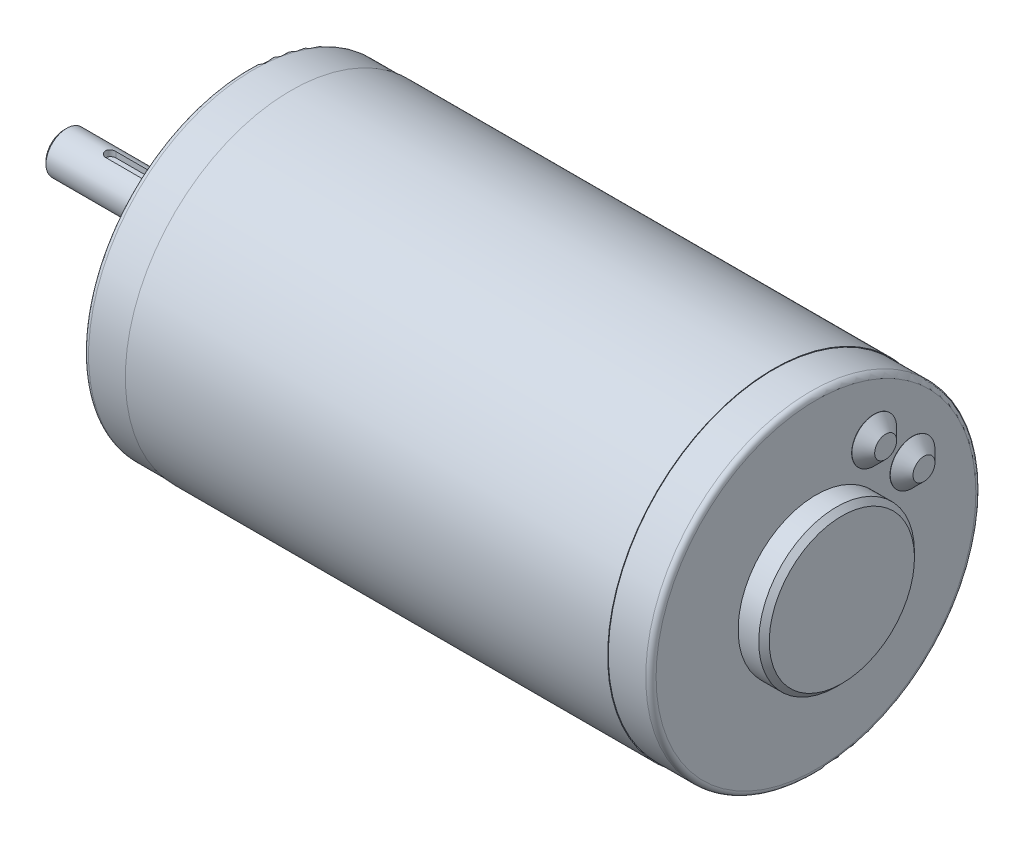
ISO-10303-21;
HEADER;
FILE_DESCRIPTION(('STEP AP214'),'2;1');
FILE_NAME('part.step','',(''),(''),'','','');
FILE_SCHEMA(('AUTOMOTIVE_DESIGN { 1 0 10303 214 1 1 1 1 }'));
ENDSEC;
DATA;
#1=APPLICATION_CONTEXT('core data for automotive mechanical design processes');
#2=APPLICATION_PROTOCOL_DEFINITION('international standard','automotive_design',2000,#1);
#3=PRODUCT_CONTEXT('',#1,'mechanical');
#4=PRODUCT('Part','Part','',(#3));
#5=PRODUCT_RELATED_PRODUCT_CATEGORY('part','',(#4));
#6=PRODUCT_DEFINITION_FORMATION('','',#4);
#7=PRODUCT_DEFINITION_CONTEXT('part definition',#1,'design');
#8=PRODUCT_DEFINITION('design','',#6,#7);
#9=PRODUCT_DEFINITION_SHAPE('','',#8);
#10=(LENGTH_UNIT() NAMED_UNIT(*) SI_UNIT(.MILLI.,.METRE.));
#11=(NAMED_UNIT(*) PLANE_ANGLE_UNIT() SI_UNIT($,.RADIAN.));
#12=(NAMED_UNIT(*) SI_UNIT($,.STERADIAN.) SOLID_ANGLE_UNIT());
#13=UNCERTAINTY_MEASURE_WITH_UNIT(LENGTH_MEASURE(1.E-05),#10,'distance_accuracy_value','');
#14=(GEOMETRIC_REPRESENTATION_CONTEXT(3) GLOBAL_UNCERTAINTY_ASSIGNED_CONTEXT((#13)) GLOBAL_UNIT_ASSIGNED_CONTEXT((#10,
#11,#12)) REPRESENTATION_CONTEXT('',''));
#15=CARTESIAN_POINT('',(0.,0.,0.));
#16=DIRECTION('',(0.,0.,1.));
#17=DIRECTION('',(1.,0.,0.));
#18=AXIS2_PLACEMENT_3D('',#15,#16,#17);
#19=CARTESIAN_POINT('',(-27.6,2.79999999999999,-1.));
#20=DIRECTION('',(0.,-1.,0.));
#21=DIRECTION('',(0.,0.,-1.));
#22=AXIS2_PLACEMENT_3D('',#19,#20,#21);
#23=PLANE('',#22);
#24=CARTESIAN_POINT('',(-7.1,2.79999999999999,0.));
#25=DIRECTION('',(0.,1.,0.));
#26=DIRECTION('',(0.,0.,1.));
#27=AXIS2_PLACEMENT_3D('',#24,#25,#26);
#28=CIRCLE('',#27,1.);
#29=CARTESIAN_POINT('',(-7.1,2.79999999999999,1.));
#30=VERTEX_POINT('',#29);
#31=CARTESIAN_POINT('',(-7.1,2.79999999999999,-1.));
#32=VERTEX_POINT('',#31);
#33=EDGE_CURVE('E81',#30,#32,#28,.T.);
#34=ORIENTED_EDGE('',*,*,#33,.T.);
#35=DIRECTION('',(1.,0.,0.));
#36=VECTOR('',#35,1.);
#37=CARTESIAN_POINT('',(-27.6,2.79999999999999,-1.));
#38=LINE('',#37,#36);
#39=CARTESIAN_POINT('',(-26.6,2.79999999999999,-1.));
#40=VERTEX_POINT('',#39);
#41=EDGE_CURVE('E76',#40,#32,#38,.T.);
#42=ORIENTED_EDGE('',*,*,#41,.F.);
#43=CARTESIAN_POINT('',(-26.6,2.79999999999999,0.));
#44=DIRECTION('',(0.,-1.,0.));
#45=DIRECTION('',(0.,0.,-1.));
#46=AXIS2_PLACEMENT_3D('',#43,#44,#45);
#47=CIRCLE('',#46,1.);
#48=CARTESIAN_POINT('',(-26.6,2.79999999999999,1.));
#49=VERTEX_POINT('',#48);
#50=EDGE_CURVE('E78',#40,#49,#47,.F.);
#51=ORIENTED_EDGE('',*,*,#50,.T.);
#52=DIRECTION('',(1.,0.,0.));
#53=VECTOR('',#52,1.);
#54=CARTESIAN_POINT('',(-27.6,2.79999999999999,1.));
#55=LINE('',#54,#53);
#56=EDGE_CURVE('E104',#49,#30,#55,.T.);
#57=ORIENTED_EDGE('',*,*,#56,.T.);
#58=EDGE_LOOP('',(#34,#42,#51,#57));
#59=FACE_BOUND('',#58,.T.);
#60=ADVANCED_FACE('F18',(#59),#23,.F.);
#61=CARTESIAN_POINT('',(-35.6,0.,0.));
#62=DIRECTION('',(-1.,0.,0.));
#63=DIRECTION('',(0.,0.,1.));
#64=AXIS2_PLACEMENT_3D('',#61,#62,#63);
#65=PLANE('',#64);
#66=CARTESIAN_POINT('',(-35.6000000000449,0.,0.));
#67=DIRECTION('',(1.,0.,0.));
#68=DIRECTION('',(0.,0.,-1.));
#69=AXIS2_PLACEMENT_3D('',#66,#67,#68);
#70=CIRCLE('',#69,3.49999999997408);
#71=CARTESIAN_POINT('',(-35.6000000000449,0.,-3.49999999997408));
#72=VERTEX_POINT('',#71);
#73=EDGE_CURVE('E326',#72,#72,#70,.T.);
#74=ORIENTED_EDGE('',*,*,#73,.F.);
#75=EDGE_LOOP('',(#74));
#76=FACE_BOUND('',#75,.T.);
#77=ADVANCED_FACE('F614',(#76),#65,.T.);
#78=CARTESIAN_POINT('',(-26.6,3.87298334620741,0.));
#79=DIRECTION('',(0.,-1.,0.));
#80=DIRECTION('',(0.,0.,-1.));
#81=AXIS2_PLACEMENT_3D('',#78,#79,#80);
#82=CYLINDRICAL_SURFACE('',#81,1.);
#83=CARTESIAN_POINT('',(-26.6,3.87298334620741,1.));
#84=CARTESIAN_POINT('',(-26.6276629851065,3.87298148580177,1.00000033749611));
#85=CARTESIAN_POINT('',(-26.6553122630182,3.8732800994947,0.998851407375366));
#86=CARTESIAN_POINT('',(-26.7104040353036,3.87445904774558,0.994271295395754));
#87=CARTESIAN_POINT('',(-26.7378465636871,3.87533928441687,0.99084049757268));
#88=CARTESIAN_POINT('',(-26.8194531732088,3.87881710972053,0.977175239382527));
#89=CARTESIAN_POINT('',(-26.8730564684822,3.88225203148808,0.963567695172493));
#90=CARTESIAN_POINT('',(-26.977124673782,3.89095422588002,0.927798076247996));
#91=CARTESIAN_POINT('',(-27.0275898782129,3.89622132630929,0.905636805423835));
#92=CARTESIAN_POINT('',(-27.1241114486473,3.90799134471939,0.853415378025865));
#93=CARTESIAN_POINT('',(-27.170166627891,3.91449459395647,0.823353103356933));
#94=CARTESIAN_POINT('',(-27.2575438819061,3.92816262398025,0.755484471828068));
#95=CARTESIAN_POINT('',(-27.2987548862455,3.93533791028915,0.717537268783974));
#96=CARTESIAN_POINT('',(-27.3743020894827,3.94945104396193,0.635275780516228));
#97=CARTESIAN_POINT('',(-27.4086371894679,3.95638885322537,0.590960479478829));
#98=CARTESIAN_POINT('',(-27.4699110016186,3.96936182283248,0.496456899401689));
#99=CARTESIAN_POINT('',(-27.496739895984,3.9753830468173,0.446195340334472));
#100=CARTESIAN_POINT('',(-27.5415247341967,3.98572346250588,0.341702590842916));
#101=CARTESIAN_POINT('',(-27.5594824242998,3.990042989147,0.287472184083007));
#102=CARTESIAN_POINT('',(-27.5856589927774,3.99641900005128,0.177744108525158));
#103=CARTESIAN_POINT('',(-27.5940676724228,3.998519529013,0.122294322002856));
#104=CARTESIAN_POINT('',(-27.6015033715433,4.00037438150815,0.0107327756816783));
#105=CARTESIAN_POINT('',(-27.6005315701923,4.00012899993444,-0.0453789000287066));
#106=CARTESIAN_POINT('',(-27.5893700363145,3.99735237365735,-0.155352492972097));
#107=CARTESIAN_POINT('',(-27.5793853834005,3.9948719867736,-0.209236701739855));
#108=CARTESIAN_POINT('',(-27.5508113208172,3.98796330636495,-0.31453871108434));
#109=CARTESIAN_POINT('',(-27.5322215304314,3.98353492665556,-0.365956402423988));
#110=CARTESIAN_POINT('',(-27.4867987193293,3.97314997761798,-0.46540728602454));
#111=CARTESIAN_POINT('',(-27.4598926057672,3.96717993827555,-0.513405629602248));
#112=CARTESIAN_POINT('',(-27.3986568701665,3.95435945541919,-0.604276631230015));
#113=CARTESIAN_POINT('',(-27.3643261297468,3.94750887933198,-0.64714851556229));
#114=CARTESIAN_POINT('',(-27.2881210879187,3.93345566022865,-0.727769389708492));
#115=CARTESIAN_POINT('',(-27.2460683634602,3.92624850477685,-0.765349103054128));
#116=CARTESIAN_POINT('',(-27.1561701330723,3.91246168284006,-0.832969575186237));
#117=CARTESIAN_POINT('',(-27.1083230467164,3.90588218842993,-0.863008270245062));
#118=CARTESIAN_POINT('',(-27.0078544021762,3.89407813586325,-0.914804709285962));
#119=CARTESIAN_POINT('',(-26.9552085351039,3.88886106009136,-0.936517017887269));
#120=CARTESIAN_POINT('',(-26.8468830715817,3.88047058807055,-0.970702351849828));
#121=CARTESIAN_POINT('',(-26.7912081448502,3.87729413761435,-0.983189189212132));
#122=CARTESIAN_POINT('',(-26.7125426192411,3.87455290681524,-0.993904635150938));
#123=CARTESIAN_POINT('',(-26.6900802967868,3.87396523110859,-0.996190790966708));
#124=CARTESIAN_POINT('',(-26.6450822100907,3.87318062488974,-0.999236757697394));
#125=CARTESIAN_POINT('',(-26.6225466240447,3.87298306219461,-0.999999038096045));
#126=CARTESIAN_POINT('',(-26.6,3.87298334620741,-1.));
#127=B_SPLINE_CURVE_WITH_KNOTS('',3,(#83,#84,#85,#86,#87,#88,#89,#90,#91,#92,#93,#94,#95,#96,
#97,#98,#99,#100,#101,#102,#103,#104,#105,#106,#107,#108,#109,#110,#111,#112,#113,#114,#115,
#116,#117,#118,#119,#120,#121,#122,#123,#124,#125,#126),.UNSPECIFIED.,.F.,.F.,(4,2,2,2,2,2,2,2,
2,2,2,2,2,2,2,2,2,2,2,2,2,4),(0.,0.0829365303397693,0.16585910608465,0.331229963080318,
0.496585282091499,0.661984974726751,0.830641897427977,0.999325753539196,1.17036187098235,
1.34136430732425,1.50890481515325,1.67642426256639,1.84022545479276,2.00403389475838,
2.16932509450376,2.33464120964329,2.50441429534542,2.67423379180967,2.84496720161068,
3.01544447539986,3.08315848722648,3.15076267731671),.UNSPECIFIED.);
#128=CARTESIAN_POINT('',(-26.6,3.87298334620741,1.));
#129=VERTEX_POINT('',#128);
#130=CARTESIAN_POINT('',(-26.6,3.87298334620741,-1.));
#131=VERTEX_POINT('',#130);
#132=EDGE_CURVE('E162',#129,#131,#127,.T.);
#133=ORIENTED_EDGE('',*,*,#132,.F.);
#134=DIRECTION('',(0.,1.,0.));
#135=VECTOR('',#134,1.);
#136=CARTESIAN_POINT('',(-26.6,2.79999999999999,1.));
#137=LINE('',#136,#135);
#138=EDGE_CURVE('E91',#129,#49,#137,.F.);
#139=ORIENTED_EDGE('',*,*,#138,.T.);
#140=ORIENTED_EDGE('',*,*,#50,.F.);
#141=DIRECTION('',(0.,1.,0.));
#142=VECTOR('',#141,1.);
#143=CARTESIAN_POINT('',(-26.6,2.79999999999999,-1.));
#144=LINE('',#143,#142);
#145=EDGE_CURVE('E85',#131,#40,#144,.F.);
#146=ORIENTED_EDGE('',*,*,#145,.F.);
#147=EDGE_LOOP('',(#133,#139,#140,#146));
#148=FACE_BOUND('',#147,.T.);
#149=ADVANCED_FACE('F88',(#148),#82,.F.);
#150=CARTESIAN_POINT('',(-27.6,2.79999999999999,-1.));
#151=DIRECTION('',(0.,0.,1.));
#152=DIRECTION('',(1.,0.,0.));
#153=AXIS2_PLACEMENT_3D('',#150,#151,#152);
#154=PLANE('',#153);
#155=DIRECTION('',(1.,0.,0.));
#156=VECTOR('',#155,1.);
#157=CARTESIAN_POINT('',(0.,3.87298334620741,-1.));
#158=LINE('',#157,#156);
#159=CARTESIAN_POINT('',(-7.1,3.87298334620741,-1.));
#160=VERTEX_POINT('',#159);
#161=EDGE_CURVE('E96',#131,#160,#158,.T.);
#162=ORIENTED_EDGE('',*,*,#161,.F.);
#163=ORIENTED_EDGE('',*,*,#145,.T.);
#164=ORIENTED_EDGE('',*,*,#41,.T.);
#165=DIRECTION('',(0.,1.,0.));
#166=VECTOR('',#165,1.);
#167=CARTESIAN_POINT('',(-7.1,2.79999999999999,-1.));
#168=LINE('',#167,#166);
#169=EDGE_CURVE('E99',#32,#160,#168,.T.);
#170=ORIENTED_EDGE('',*,*,#169,.T.);
#171=EDGE_LOOP('',(#162,#163,#164,#170));
#172=FACE_BOUND('',#171,.T.);
#173=ADVANCED_FACE('F94',(#172),#154,.T.);
#174=CARTESIAN_POINT('',(-7.1,2.79999999999999,0.));
#175=DIRECTION('',(0.,1.,0.));
#176=DIRECTION('',(0.,0.,1.));
#177=AXIS2_PLACEMENT_3D('',#174,#175,#176);
#178=CYLINDRICAL_SURFACE('',#177,1.);
#179=ORIENTED_EDGE('',*,*,#33,.F.);
#180=DIRECTION('',(0.,1.,0.));
#181=VECTOR('',#180,1.);
#182=CARTESIAN_POINT('',(-7.1,2.79999999999999,1.));
#183=LINE('',#182,#181);
#184=CARTESIAN_POINT('',(-7.1,3.87298334620741,1.));
#185=VERTEX_POINT('',#184);
#186=EDGE_CURVE('E105',#30,#185,#183,.T.);
#187=ORIENTED_EDGE('',*,*,#186,.T.);
#188=CARTESIAN_POINT('',(-7.1,3.87298334620741,-1.));
#189=CARTESIAN_POINT('',(-7.07233701489346,3.87298148580177,-1.00000033749611));
#190=CARTESIAN_POINT('',(-7.04468773698177,3.8732800994947,-0.998851407375366));
#191=CARTESIAN_POINT('',(-6.98959596469644,3.87445904774558,-0.994271295395754));
#192=CARTESIAN_POINT('',(-6.96215343631291,3.87533928441687,-0.990840497572679));
#193=CARTESIAN_POINT('',(-6.88054682679116,3.87881710972053,-0.977175239382527));
#194=CARTESIAN_POINT('',(-6.82694353151779,3.88225203148808,-0.963567695172494));
#195=CARTESIAN_POINT('',(-6.72287532621804,3.89095422588002,-0.927798076247997));
#196=CARTESIAN_POINT('',(-6.67241012178715,3.89622132630929,-0.905636805423836));
#197=CARTESIAN_POINT('',(-6.57588855135267,3.90799134471939,-0.853415378025865));
#198=CARTESIAN_POINT('',(-6.52983337210904,3.91449459395647,-0.823353103356933));
#199=CARTESIAN_POINT('',(-6.4424561180939,3.92816262398025,-0.755484471828069));
#200=CARTESIAN_POINT('',(-6.40124511375448,3.93533791028915,-0.717537268783976));
#201=CARTESIAN_POINT('',(-6.3256979105173,3.94945104396193,-0.63527578051623));
#202=CARTESIAN_POINT('',(-6.29136281053206,3.95638885322537,-0.590960479478831));
#203=CARTESIAN_POINT('',(-6.23008899838136,3.96936182283248,-0.496456899401691));
#204=CARTESIAN_POINT('',(-6.20326010401603,3.9753830468173,-0.446195340334474));
#205=CARTESIAN_POINT('',(-6.1584752658033,3.98572346250588,-0.341702590842919));
#206=CARTESIAN_POINT('',(-6.14051757570017,3.990042989147,-0.28747218408301));
#207=CARTESIAN_POINT('',(-6.11434100722257,3.99641900005128,-0.17774410852516));
#208=CARTESIAN_POINT('',(-6.10593232757718,3.998519529013,-0.122294322002858));
#209=CARTESIAN_POINT('',(-6.09849662845671,4.00037438150815,-0.0107327756816796));
#210=CARTESIAN_POINT('',(-6.09946842980766,4.00012899993444,0.0453789000287056));
#211=CARTESIAN_POINT('',(-6.11062996368545,3.99735237365735,0.155352492972096));
#212=CARTESIAN_POINT('',(-6.12061461659948,3.9948719867736,0.209236701739855));
#213=CARTESIAN_POINT('',(-6.14918867918275,3.98796330636495,0.31453871108434));
#214=CARTESIAN_POINT('',(-6.16777846956858,3.98353492665556,0.365956402423988));
#215=CARTESIAN_POINT('',(-6.21320128067065,3.97314997761798,0.465407286024539));
#216=CARTESIAN_POINT('',(-6.24010739423284,3.96717993827555,0.513405629602249));
#217=CARTESIAN_POINT('',(-6.30134312983347,3.95435945541919,0.604276631230014));
#218=CARTESIAN_POINT('',(-6.33567387025322,3.94750887933198,0.647148515562289));
#219=CARTESIAN_POINT('',(-6.41187891208131,3.93345566022865,0.72776938970849));
#220=CARTESIAN_POINT('',(-6.45393163653982,3.92624850477685,0.765349103054127));
#221=CARTESIAN_POINT('',(-6.54382986692774,3.91246168284006,0.832969575186237));
#222=CARTESIAN_POINT('',(-6.59167695328356,3.90588218842993,0.863008270245062));
#223=CARTESIAN_POINT('',(-6.69214559782377,3.89407813586325,0.914804709285962));
#224=CARTESIAN_POINT('',(-6.74479146489609,3.88886106009136,0.936517017887269));
#225=CARTESIAN_POINT('',(-6.85311692841829,3.88047058807055,0.970702351849828));
#226=CARTESIAN_POINT('',(-6.90879185514984,3.87729413761435,0.983189189212131));
#227=CARTESIAN_POINT('',(-6.98745738075891,3.87455290681524,0.993904635150938));
#228=CARTESIAN_POINT('',(-7.00991970321318,3.87396523110859,0.996190790966708));
#229=CARTESIAN_POINT('',(-7.05491778990932,3.87318062488974,0.999236757697394));
#230=CARTESIAN_POINT('',(-7.07745337595529,3.8729830621946,0.999999038096045));
#231=CARTESIAN_POINT('',(-7.1,3.87298334620741,1.));
#232=B_SPLINE_CURVE_WITH_KNOTS('',3,(#188,#189,#190,#191,#192,#193,#194,#195,#196,#197,#198,
#199,#200,#201,#202,#203,#204,#205,#206,#207,#208,#209,#210,#211,#212,#213,#214,#215,#216,#217,
#218,#219,#220,#221,#222,#223,#224,#225,#226,#227,#228,#229,#230,#231),.UNSPECIFIED.,.F.,.F.,(4,
2,2,2,2,2,2,2,2,2,2,2,2,2,2,2,2,2,2,2,2,4),(0.,0.0829365303397684,0.165859106084651,
0.331229963080317,0.496585282091498,0.661984974726749,0.830641897427974,0.999325753539193,
1.17036187098235,1.34136430732424,1.50890481515325,1.67642426256639,1.84022545479276,
2.00403389475838,2.16932509450376,2.33464120964329,2.50441429534542,2.67423379180967,
2.84496720161068,3.01544447539986,3.08315848722648,3.15076267731671),.UNSPECIFIED.);
#233=EDGE_CURVE('E153',#160,#185,#232,.T.);
#234=ORIENTED_EDGE('',*,*,#233,.F.);
#235=ORIENTED_EDGE('',*,*,#169,.F.);
#236=EDGE_LOOP('',(#179,#187,#234,#235));
#237=FACE_BOUND('',#236,.T.);
#238=ADVANCED_FACE('F168',(#237),#178,.F.);
#239=CARTESIAN_POINT('',(-27.6,2.79999999999999,1.));
#240=DIRECTION('',(0.,0.,1.));
#241=DIRECTION('',(1.,0.,0.));
#242=AXIS2_PLACEMENT_3D('',#239,#240,#241);
#243=PLANE('',#242);
#244=ORIENTED_EDGE('',*,*,#186,.F.);
#245=ORIENTED_EDGE('',*,*,#56,.F.);
#246=ORIENTED_EDGE('',*,*,#138,.F.);
#247=DIRECTION('',(1.,0.,0.));
#248=VECTOR('',#247,1.);
#249=CARTESIAN_POINT('',(0.,3.87298334620741,1.));
#250=LINE('',#249,#248);
#251=EDGE_CURVE('E161',#185,#129,#250,.F.);
#252=ORIENTED_EDGE('',*,*,#251,.F.);
#253=EDGE_LOOP('',(#244,#245,#246,#252));
#254=FACE_BOUND('',#253,.T.);
#255=ADVANCED_FACE('F183',(#254),#243,.F.);
#256=CARTESIAN_POINT('',(-35.0999999999999,0.,0.));
#257=DIRECTION('',(1.,0.,0.));
#258=DIRECTION('',(0.,0.,-1.));
#259=AXIS2_PLACEMENT_3D('',#256,#257,#258);
#260=CONICAL_SURFACE('',#259,3.99999999996226,0.785398163340605);
#261=ORIENTED_EDGE('',*,*,#73,.T.);
#262=EDGE_LOOP('',(#261));
#263=FACE_BOUND('',#262,.T.);
#264=CARTESIAN_POINT('',(-35.1,0.,0.));
#265=DIRECTION('',(1.,0.,0.));
#266=DIRECTION('',(0.,0.,-1.));
#267=AXIS2_PLACEMENT_3D('',#264,#265,#266);
#268=CIRCLE('',#267,4.);
#269=CARTESIAN_POINT('',(-35.1,0.,-4.));
#270=VERTEX_POINT('',#269);
#271=EDGE_CURVE('E152',#270,#270,#268,.T.);
#272=ORIENTED_EDGE('',*,*,#271,.F.);
#273=EDGE_LOOP('',(#272));
#274=FACE_BOUND('',#273,.T.);
#275=ADVANCED_FACE('F178',(#263,#274),#260,.T.);
#276=CARTESIAN_POINT('',(0.,0.,0.));
#277=DIRECTION('',(1.,0.,0.));
#278=DIRECTION('',(0.,0.,-1.));
#279=AXIS2_PLACEMENT_3D('',#276,#277,#278);
#280=CYLINDRICAL_SURFACE('',#279,4.);
#281=ORIENTED_EDGE('',*,*,#271,.T.);
#282=EDGE_LOOP('',(#281));
#283=FACE_BOUND('',#282,.T.);
#284=CARTESIAN_POINT('',(-4.,0.,0.));
#285=DIRECTION('',(1.,0.,0.));
#286=DIRECTION('',(0.,0.,-1.));
#287=AXIS2_PLACEMENT_3D('',#284,#285,#286);
#288=CIRCLE('',#287,4.);
#289=CARTESIAN_POINT('',(-4.,0.,-4.));
#290=VERTEX_POINT('',#289);
#291=EDGE_CURVE('E149',#290,#290,#288,.T.);
#292=ORIENTED_EDGE('',*,*,#291,.F.);
#293=EDGE_LOOP('',(#292));
#294=FACE_BOUND('',#293,.T.);
#295=ORIENTED_EDGE('',*,*,#233,.T.);
#296=ORIENTED_EDGE('',*,*,#251,.T.);
#297=ORIENTED_EDGE('',*,*,#132,.T.);
#298=ORIENTED_EDGE('',*,*,#161,.T.);
#299=EDGE_LOOP('',(#295,#296,#297,#298));
#300=FACE_BOUND('',#299,.T.);
#301=ADVANCED_FACE('F172',(#283,#294,#300),#280,.T.);
#302=CARTESIAN_POINT('',(-4.,4.,0.));
#303=DIRECTION('',(-1.,0.,0.));
#304=DIRECTION('',(0.,0.,1.));
#305=AXIS2_PLACEMENT_3D('',#302,#303,#304);
#306=PLANE('',#305);
#307=ORIENTED_EDGE('',*,*,#291,.T.);
#308=EDGE_LOOP('',(#307));
#309=FACE_BOUND('',#308,.T.);
#310=CARTESIAN_POINT('',(-4.,0.,0.));
#311=DIRECTION('',(1.,0.,0.));
#312=DIRECTION('',(0.,1.,0.));
#313=AXIS2_PLACEMENT_3D('',#310,#311,#312);
#314=CIRCLE('',#313,8.509);
#315=CARTESIAN_POINT('',(-4.,8.509,0.));
#316=VERTEX_POINT('',#315);
#317=EDGE_CURVE('E146',#316,#316,#314,.T.);
#318=ORIENTED_EDGE('',*,*,#317,.F.);
#319=EDGE_LOOP('',(#318));
#320=FACE_BOUND('',#319,.T.);
#321=ADVANCED_FACE('F177',(#309,#320),#306,.T.);
#322=CARTESIAN_POINT('',(111.8479,18.6070906828553,-11.2073596390943));
#323=DIRECTION('',(1.,0.,0.));
#324=DIRECTION('',(0.,0.,-1.));
#325=AXIS2_PLACEMENT_3D('',#322,#323,#324);
#326=PLANE('',#325);
#327=CARTESIAN_POINT('',(111.84789999993,18.6070906828553,-11.2073596390943));
#328=DIRECTION('',(-1.,0.,0.));
#329=DIRECTION('',(0.,-1.,0.));
#330=AXIS2_PLACEMENT_3D('',#327,#328,#329);
#331=CIRCLE('',#330,2.11800000003146);
#332=CARTESIAN_POINT('',(111.84789999993,16.4890906828238,-11.2073596390943));
#333=VERTEX_POINT('',#332);
#334=EDGE_CURVE('E143',#333,#333,#331,.T.);
#335=ORIENTED_EDGE('',*,*,#334,.F.);
#336=EDGE_LOOP('',(#335));
#337=FACE_BOUND('',#336,.T.);
#338=ADVANCED_FACE('F473',(#337),#326,.T.);
#339=CARTESIAN_POINT('',(114.6,15.0368,0.));
#340=DIRECTION('',(1.,0.,0.));
#341=DIRECTION('',(0.,0.,-1.));
#342=AXIS2_PLACEMENT_3D('',#339,#340,#341);
#343=PLANE('',#342);
#344=CARTESIAN_POINT('',(114.6,0.,0.));
#345=DIRECTION('',(-1.,0.,0.));
#346=DIRECTION('',(0.,-1.,0.));
#347=AXIS2_PLACEMENT_3D('',#344,#345,#346);
#348=CIRCLE('',#347,14.0208);
#349=CARTESIAN_POINT('',(114.6,-14.0208,0.));
#350=VERTEX_POINT('',#349);
#351=EDGE_CURVE('E140',#350,#350,#348,.T.);
#352=ORIENTED_EDGE('',*,*,#351,.F.);
#353=EDGE_LOOP('',(#352));
#354=FACE_BOUND('',#353,.T.);
#355=ADVANCED_FACE('F463',(#354),#343,.T.);
#356=CARTESIAN_POINT('',(111.8479,11.2073596390943,-18.6070906828553));
#357=DIRECTION('',(1.,0.,0.));
#358=DIRECTION('',(0.,0.,-1.));
#359=AXIS2_PLACEMENT_3D('',#356,#357,#358);
#360=PLANE('',#359);
#361=CARTESIAN_POINT('',(111.84789999993,11.2073596390943,-18.6070906828553));
#362=DIRECTION('',(-1.,0.,0.));
#363=DIRECTION('',(0.,0.,1.));
#364=AXIS2_PLACEMENT_3D('',#361,#362,#363);
#365=CIRCLE('',#364,2.1180000000021);
#366=CARTESIAN_POINT('',(111.84789999993,11.2073596390943,-16.4890906828532));
#367=VERTEX_POINT('',#366);
#368=EDGE_CURVE('E136',#367,#367,#365,.T.);
#369=ORIENTED_EDGE('',*,*,#368,.F.);
#370=EDGE_LOOP('',(#369));
#371=FACE_BOUND('',#370,.T.);
#372=ADVANCED_FACE('F457',(#371),#360,.T.);
#373=CARTESIAN_POINT('',(13.6143999999945,25.4,0.));
#374=DIRECTION('',(-1.,0.,0.));
#375=DIRECTION('',(0.,0.,1.));
#376=AXIS2_PLACEMENT_3D('',#373,#374,#375);
#377=CONICAL_SURFACE('',#376,2.01929999997219,1.02974425867198);
#378=CARTESIAN_POINT('',(14.827717847993,25.4,0.));
#379=VERTEX_POINT('',#378);
#380=VERTEX_LOOP('',#379);
#381=FACE_BOUND('',#380,.T.);
#382=CARTESIAN_POINT('',(13.6144,25.4,0.));
#383=DIRECTION('',(-1.,0.,0.));
#384=DIRECTION('',(0.,0.,1.));
#385=AXIS2_PLACEMENT_3D('',#382,#383,#384);
#386=CIRCLE('',#385,2.0193);
#387=CARTESIAN_POINT('',(13.6144,25.4,2.0193));
#388=VERTEX_POINT('',#387);
#389=EDGE_CURVE('E139',#388,#388,#386,.T.);
#390=ORIENTED_EDGE('',*,*,#389,.T.);
#391=EDGE_LOOP('',(#390));
#392=FACE_BOUND('',#391,.T.);
#393=ADVANCED_FACE('F462',(#381,#392),#377,.F.);
#394=CARTESIAN_POINT('',(13.6143999999945,-25.4,0.));
#395=DIRECTION('',(-1.,0.,0.));
#396=DIRECTION('',(0.,0.,1.));
#397=AXIS2_PLACEMENT_3D('',#394,#395,#396);
#398=CONICAL_SURFACE('',#397,2.01929999997219,1.02974425867198);
#399=CARTESIAN_POINT('',(14.827717847993,-25.4,0.));
#400=VERTEX_POINT('',#399);
#401=VERTEX_LOOP('',#400);
#402=FACE_BOUND('',#401,.T.);
#403=CARTESIAN_POINT('',(13.6144,-25.4,0.));
#404=DIRECTION('',(-1.,0.,0.));
#405=DIRECTION('',(0.,0.,1.));
#406=AXIS2_PLACEMENT_3D('',#403,#404,#405);
#407=CIRCLE('',#406,2.0193);
#408=CARTESIAN_POINT('',(13.6144,-25.4,2.0193));
#409=VERTEX_POINT('',#408);
#410=EDGE_CURVE('E316',#409,#409,#407,.T.);
#411=ORIENTED_EDGE('',*,*,#410,.T.);
#412=EDGE_LOOP('',(#411));
#413=FACE_BOUND('',#412,.T.);
#414=ADVANCED_FACE('F521',(#402,#413),#398,.F.);
#415=CARTESIAN_POINT('',(-2.984,0.,0.));
#416=DIRECTION('',(1.,0.,0.));
#417=DIRECTION('',(0.,1.,0.));
#418=AXIS2_PLACEMENT_3D('',#415,#416,#417);
#419=CONICAL_SURFACE('',#418,9.525,0.78539816339745);
#420=ORIENTED_EDGE('',*,*,#317,.T.);
#421=EDGE_LOOP('',(#420));
#422=FACE_BOUND('',#421,.T.);
#423=CARTESIAN_POINT('',(-2.984,0.,0.));
#424=DIRECTION('',(1.,0.,0.));
#425=DIRECTION('',(0.,0.,-1.));
#426=AXIS2_PLACEMENT_3D('',#423,#424,#425);
#427=CIRCLE('',#426,9.525);
#428=CARTESIAN_POINT('',(-2.984,0.,-9.525));
#429=VERTEX_POINT('',#428);
#430=EDGE_CURVE('E313',#429,#429,#427,.T.);
#431=ORIENTED_EDGE('',*,*,#430,.F.);
#432=EDGE_LOOP('',(#431));
#433=FACE_BOUND('',#432,.T.);
#434=ADVANCED_FACE('F449',(#422,#433),#419,.T.);
#435=CARTESIAN_POINT('',(109.647900000027,18.6070906828553,-11.2073596390943));
#436=DIRECTION('',(-1.,0.,0.));
#437=DIRECTION('',(0.,-1.,0.));
#438=AXIS2_PLACEMENT_3D('',#435,#436,#437);
#439=CONICAL_SURFACE('',#438,4.31799999987712,0.785398163384529);
#440=CARTESIAN_POINT('',(109.6479,18.6070906828553,-11.2073596390943));
#441=DIRECTION('',(-1.,0.,0.));
#442=DIRECTION('',(0.,0.,1.));
#443=AXIS2_PLACEMENT_3D('',#440,#441,#442);
#444=CIRCLE('',#443,4.318);
#445=CARTESIAN_POINT('',(109.6479,18.6070906828553,-6.88935963909434));
#446=VERTEX_POINT('',#445);
#447=EDGE_CURVE('E310',#446,#446,#444,.T.);
#448=ORIENTED_EDGE('',*,*,#447,.F.);
#449=EDGE_LOOP('',(#448));
#450=FACE_BOUND('',#449,.T.);
#451=ORIENTED_EDGE('',*,*,#334,.T.);
#452=EDGE_LOOP('',(#451));
#453=FACE_BOUND('',#452,.T.);
#454=ADVANCED_FACE('F444',(#450,#453),#439,.T.);
#455=CARTESIAN_POINT('',(113.584,0.,0.));
#456=DIRECTION('',(-1.,0.,0.));
#457=DIRECTION('',(0.,-1.,0.));
#458=AXIS2_PLACEMENT_3D('',#455,#456,#457);
#459=CONICAL_SURFACE('',#458,15.0368,0.785398163397441);
#460=ORIENTED_EDGE('',*,*,#351,.T.);
#461=EDGE_LOOP('',(#460));
#462=FACE_BOUND('',#461,.T.);
#463=CARTESIAN_POINT('',(113.584,0.,0.));
#464=DIRECTION('',(1.,0.,0.));
#465=DIRECTION('',(0.,0.,-1.));
#466=AXIS2_PLACEMENT_3D('',#463,#464,#465);
#467=CIRCLE('',#466,15.0368);
#468=CARTESIAN_POINT('',(113.584,0.,-15.0368));
#469=VERTEX_POINT('',#468);
#470=EDGE_CURVE('E307',#469,#469,#467,.F.);
#471=ORIENTED_EDGE('',*,*,#470,.F.);
#472=EDGE_LOOP('',(#471));
#473=FACE_BOUND('',#472,.T.);
#474=ADVANCED_FACE('F436',(#462,#473),#459,.T.);
#475=CARTESIAN_POINT('',(109.647900000084,11.2073596390943,-18.6070906828553));
#476=DIRECTION('',(-1.,0.,0.));
#477=DIRECTION('',(0.,0.,1.));
#478=AXIS2_PLACEMENT_3D('',#475,#476,#477);
#479=CONICAL_SURFACE('',#478,4.31799999990461,0.785398163410367);
#480=CARTESIAN_POINT('',(109.6479,11.2073596390943,-18.6070906828553));
#481=DIRECTION('',(-1.,0.,0.));
#482=DIRECTION('',(0.,0.,1.));
#483=AXIS2_PLACEMENT_3D('',#480,#481,#482);
#484=CIRCLE('',#483,4.318);
#485=CARTESIAN_POINT('',(109.6479,11.2073596390943,-14.2890906828553));
#486=VERTEX_POINT('',#485);
#487=EDGE_CURVE('E135',#486,#486,#484,.T.);
#488=ORIENTED_EDGE('',*,*,#487,.F.);
#489=EDGE_LOOP('',(#488));
#490=FACE_BOUND('',#489,.T.);
#491=ORIENTED_EDGE('',*,*,#368,.T.);
#492=EDGE_LOOP('',(#491));
#493=FACE_BOUND('',#492,.T.);
#494=ADVANCED_FACE('F426',(#490,#493),#479,.T.);
#495=CARTESIAN_POINT('',(0.,25.4,0.));
#496=DIRECTION('',(-1.,0.,0.));
#497=DIRECTION('',(0.,0.,1.));
#498=AXIS2_PLACEMENT_3D('',#495,#496,#497);
#499=CYLINDRICAL_SURFACE('',#498,2.0193);
#500=CARTESIAN_POINT('',(0.,25.4,0.));
#501=DIRECTION('',(-1.,0.,0.));
#502=DIRECTION('',(0.,0.,1.));
#503=AXIS2_PLACEMENT_3D('',#500,#501,#502);
#504=CIRCLE('',#503,2.0193);
#505=CARTESIAN_POINT('',(0.,25.4,2.0193));
#506=VERTEX_POINT('',#505);
#507=EDGE_CURVE('E132',#506,#506,#504,.F.);
#508=ORIENTED_EDGE('',*,*,#507,.F.);
#509=EDGE_LOOP('',(#508));
#510=FACE_BOUND('',#509,.T.);
#511=ORIENTED_EDGE('',*,*,#389,.F.);
#512=EDGE_LOOP('',(#511));
#513=FACE_BOUND('',#512,.T.);
#514=ADVANCED_FACE('F416',(#510,#513),#499,.F.);
#515=CARTESIAN_POINT('',(0.,-25.4,0.));
#516=DIRECTION('',(-1.,0.,0.));
#517=DIRECTION('',(0.,0.,1.));
#518=AXIS2_PLACEMENT_3D('',#515,#516,#517);
#519=CYLINDRICAL_SURFACE('',#518,2.0193);
#520=CARTESIAN_POINT('',(0.,-25.4,0.));
#521=DIRECTION('',(-1.,0.,0.));
#522=DIRECTION('',(0.,0.,1.));
#523=AXIS2_PLACEMENT_3D('',#520,#521,#522);
#524=CIRCLE('',#523,2.0193);
#525=CARTESIAN_POINT('',(0.,-25.4,2.0193));
#526=VERTEX_POINT('',#525);
#527=EDGE_CURVE('E129',#526,#526,#524,.F.);
#528=ORIENTED_EDGE('',*,*,#527,.F.);
#529=EDGE_LOOP('',(#528));
#530=FACE_BOUND('',#529,.T.);
#531=ORIENTED_EDGE('',*,*,#410,.F.);
#532=EDGE_LOOP('',(#531));
#533=FACE_BOUND('',#532,.T.);
#534=ADVANCED_FACE('F411',(#530,#533),#519,.F.);
#535=CARTESIAN_POINT('',(0.,0.,0.));
#536=DIRECTION('',(1.,0.,0.));
#537=DIRECTION('',(0.,0.,-1.));
#538=AXIS2_PLACEMENT_3D('',#535,#536,#537);
#539=CYLINDRICAL_SURFACE('',#538,9.525);
#540=ORIENTED_EDGE('',*,*,#430,.T.);
#541=EDGE_LOOP('',(#540));
#542=FACE_BOUND('',#541,.T.);
#543=CARTESIAN_POINT('',(0.,0.,0.));
#544=DIRECTION('',(1.,0.,0.));
#545=DIRECTION('',(0.,0.,-1.));
#546=AXIS2_PLACEMENT_3D('',#543,#544,#545);
#547=CIRCLE('',#546,9.525);
#548=CARTESIAN_POINT('',(0.,0.,-9.525));
#549=VERTEX_POINT('',#548);
#550=EDGE_CURVE('E126',#549,#549,#547,.T.);
#551=ORIENTED_EDGE('',*,*,#550,.F.);
#552=EDGE_LOOP('',(#551));
#553=FACE_BOUND('',#552,.T.);
#554=ADVANCED_FACE('F403',(#542,#553),#539,.T.);
#555=CARTESIAN_POINT('',(111.8479,18.6070906828553,-11.2073596390943));
#556=DIRECTION('',(-1.,0.,0.));
#557=DIRECTION('',(0.,0.,1.));
#558=AXIS2_PLACEMENT_3D('',#555,#556,#557);
#559=CYLINDRICAL_SURFACE('',#558,4.318);
#560=CARTESIAN_POINT('',(109.6,18.6070906828553,-11.2073596390943));
#561=DIRECTION('',(-1.,0.,0.));
#562=DIRECTION('',(0.,0.,1.));
#563=AXIS2_PLACEMENT_3D('',#560,#561,#562);
#564=CIRCLE('',#563,4.318);
#565=CARTESIAN_POINT('',(109.6,18.6070906828553,-6.88935963909434));
#566=VERTEX_POINT('',#565);
#567=EDGE_CURVE('E123',#566,#566,#564,.T.);
#568=ORIENTED_EDGE('',*,*,#567,.F.);
#569=EDGE_LOOP('',(#568));
#570=FACE_BOUND('',#569,.T.);
#571=ORIENTED_EDGE('',*,*,#447,.T.);
#572=EDGE_LOOP('',(#571));
#573=FACE_BOUND('',#572,.T.);
#574=ADVANCED_FACE('F398',(#570,#573),#559,.T.);
#575=CARTESIAN_POINT('',(0.,0.,0.));
#576=DIRECTION('',(1.,0.,0.));
#577=DIRECTION('',(0.,0.,-1.));
#578=AXIS2_PLACEMENT_3D('',#575,#576,#577);
#579=CYLINDRICAL_SURFACE('',#578,15.0368);
#580=CARTESIAN_POINT('',(109.6,0.,0.));
#581=DIRECTION('',(1.,0.,0.));
#582=DIRECTION('',(0.,0.,-1.));
#583=AXIS2_PLACEMENT_3D('',#580,#581,#582);
#584=CIRCLE('',#583,15.0368);
#585=CARTESIAN_POINT('',(109.6,0.,-15.0368));
#586=VERTEX_POINT('',#585);
#587=EDGE_CURVE('E120',#586,#586,#584,.F.);
#588=ORIENTED_EDGE('',*,*,#587,.F.);
#589=EDGE_LOOP('',(#588));
#590=FACE_BOUND('',#589,.T.);
#591=ORIENTED_EDGE('',*,*,#470,.T.);
#592=EDGE_LOOP('',(#591));
#593=FACE_BOUND('',#592,.T.);
#594=ADVANCED_FACE('F390',(#590,#593),#579,.T.);
#595=CARTESIAN_POINT('',(111.8479,11.2073596390943,-18.6070906828553));
#596=DIRECTION('',(-1.,0.,0.));
#597=DIRECTION('',(0.,0.,1.));
#598=AXIS2_PLACEMENT_3D('',#595,#596,#597);
#599=CYLINDRICAL_SURFACE('',#598,4.318);
#600=CARTESIAN_POINT('',(109.6,11.2073596390943,-18.6070906828553));
#601=DIRECTION('',(-1.,0.,0.));
#602=DIRECTION('',(0.,0.,1.));
#603=AXIS2_PLACEMENT_3D('',#600,#601,#602);
#604=CIRCLE('',#603,4.318);
#605=CARTESIAN_POINT('',(109.6,11.2073596390943,-14.2890906828553));
#606=VERTEX_POINT('',#605);
#607=EDGE_CURVE('E116',#606,#606,#604,.T.);
#608=ORIENTED_EDGE('',*,*,#607,.F.);
#609=EDGE_LOOP('',(#608));
#610=FACE_BOUND('',#609,.T.);
#611=ORIENTED_EDGE('',*,*,#487,.T.);
#612=EDGE_LOOP('',(#611));
#613=FACE_BOUND('',#612,.T.);
#614=ADVANCED_FACE('F385',(#610,#613),#599,.T.);
#615=CARTESIAN_POINT('',(0.,9.525,0.));
#616=DIRECTION('',(-1.,0.,0.));
#617=DIRECTION('',(0.,0.,1.));
#618=AXIS2_PLACEMENT_3D('',#615,#616,#617);
#619=PLANE('',#618);
#620=ORIENTED_EDGE('',*,*,#550,.T.);
#621=EDGE_LOOP('',(#620));
#622=FACE_BOUND('',#621,.T.);
#623=CARTESIAN_POINT('',(0.,0.,0.));
#624=DIRECTION('',(1.,0.,0.));
#625=DIRECTION('',(0.,0.,-1.));
#626=AXIS2_PLACEMENT_3D('',#623,#624,#625);
#627=CIRCLE('',#626,30.877);
#628=CARTESIAN_POINT('',(0.,0.,-30.877));
#629=VERTEX_POINT('',#628);
#630=CARTESIAN_POINT('',(0.,0.,30.877));
#631=VERTEX_POINT('',#630);
#632=EDGE_CURVE('E119',#629,#631,#627,.T.);
#633=ORIENTED_EDGE('',*,*,#632,.F.);
#634=CARTESIAN_POINT('',(0.,0.,0.));
#635=DIRECTION('',(1.,0.,0.));
#636=DIRECTION('',(0.,0.,1.));
#637=AXIS2_PLACEMENT_3D('',#634,#635,#636);
#638=CIRCLE('',#637,30.877);
#639=EDGE_CURVE('E286',#631,#629,#638,.T.);
#640=ORIENTED_EDGE('',*,*,#639,.F.);
#641=EDGE_LOOP('',(#633,#640));
#642=FACE_BOUND('',#641,.T.);
#643=ORIENTED_EDGE('',*,*,#527,.T.);
#644=EDGE_LOOP('',(#643));
#645=FACE_BOUND('',#644,.T.);
#646=ORIENTED_EDGE('',*,*,#507,.T.);
#647=EDGE_LOOP('',(#646));
#648=FACE_BOUND('',#647,.T.);
#649=ADVANCED_FACE('F252',(#622,#642,#645,#648),#619,.T.);
#650=CARTESIAN_POINT('',(109.6,31.877,0.));
#651=DIRECTION('',(1.,0.,0.));
#652=DIRECTION('',(0.,0.,-1.));
#653=AXIS2_PLACEMENT_3D('',#650,#651,#652);
#654=PLANE('',#653);
#655=ORIENTED_EDGE('',*,*,#607,.T.);
#656=EDGE_LOOP('',(#655));
#657=FACE_BOUND('',#656,.T.);
#658=ORIENTED_EDGE('',*,*,#587,.T.);
#659=EDGE_LOOP('',(#658));
#660=FACE_BOUND('',#659,.T.);
#661=CARTESIAN_POINT('',(109.6,0.,0.));
#662=DIRECTION('',(-1.,0.,0.));
#663=DIRECTION('',(0.,0.,1.));
#664=AXIS2_PLACEMENT_3D('',#661,#662,#663);
#665=CIRCLE('',#664,30.877);
#666=CARTESIAN_POINT('',(109.6,0.,30.877));
#667=VERTEX_POINT('',#666);
#668=CARTESIAN_POINT('',(109.6,0.,-30.877));
#669=VERTEX_POINT('',#668);
#670=EDGE_CURVE('E37',#667,#669,#665,.T.);
#671=ORIENTED_EDGE('',*,*,#670,.F.);
#672=CARTESIAN_POINT('',(109.6,0.,0.));
#673=DIRECTION('',(-1.,0.,0.));
#674=DIRECTION('',(0.,0.,-1.));
#675=AXIS2_PLACEMENT_3D('',#672,#673,#674);
#676=CIRCLE('',#675,30.877);
#677=EDGE_CURVE('E234',#669,#667,#676,.T.);
#678=ORIENTED_EDGE('',*,*,#677,.F.);
#679=EDGE_LOOP('',(#671,#678));
#680=FACE_BOUND('',#679,.T.);
#681=ORIENTED_EDGE('',*,*,#567,.T.);
#682=EDGE_LOOP('',(#681));
#683=FACE_BOUND('',#682,.T.);
#684=ADVANCED_FACE('F243',(#657,#660,#680,#683),#654,.T.);
#685=CARTESIAN_POINT('',(0.999999999999999,0.,0.));
#686=DIRECTION('',(-1.,0.,0.));
#687=DIRECTION('',(0.,0.,1.));
#688=AXIS2_PLACEMENT_3D('',#685,#686,#687);
#689=TOROIDAL_SURFACE('',#688,30.877,1.);
#690=CARTESIAN_POINT('',(0.999999999999999,0.,0.));
#691=DIRECTION('',(1.,0.,0.));
#692=DIRECTION('',(0.,0.,-1.));
#693=AXIS2_PLACEMENT_3D('',#690,#691,#692);
#694=CIRCLE('',#693,31.877);
#695=CARTESIAN_POINT('',(0.999999999999999,0.,-31.877));
#696=VERTEX_POINT('',#695);
#697=EDGE_CURVE('E232',#696,#696,#694,.T.);
#698=ORIENTED_EDGE('',*,*,#697,.F.);
#699=EDGE_LOOP('',(#698));
#700=FACE_BOUND('',#699,.T.);
#701=ORIENTED_EDGE('',*,*,#639,.T.);
#702=ORIENTED_EDGE('',*,*,#632,.T.);
#703=EDGE_LOOP('',(#701,#702));
#704=FACE_BOUND('',#703,.T.);
#705=ADVANCED_FACE('F221',(#700,#704),#689,.T.);
#706=CARTESIAN_POINT('',(108.6,0.,0.));
#707=DIRECTION('',(1.,0.,0.));
#708=DIRECTION('',(0.,0.,-1.));
#709=AXIS2_PLACEMENT_3D('',#706,#707,#708);
#710=TOROIDAL_SURFACE('',#709,30.877,1.);
#711=CARTESIAN_POINT('',(108.6,0.,0.));
#712=DIRECTION('',(1.,0.,0.));
#713=DIRECTION('',(0.,0.,-1.));
#714=AXIS2_PLACEMENT_3D('',#711,#712,#713);
#715=CIRCLE('',#714,31.877);
#716=CARTESIAN_POINT('',(108.6,0.,-31.877));
#717=VERTEX_POINT('',#716);
#718=EDGE_CURVE('E115',#717,#717,#715,.F.);
#719=ORIENTED_EDGE('',*,*,#718,.F.);
#720=EDGE_LOOP('',(#719));
#721=FACE_BOUND('',#720,.T.);
#722=ORIENTED_EDGE('',*,*,#677,.T.);
#723=ORIENTED_EDGE('',*,*,#670,.T.);
#724=EDGE_LOOP('',(#722,#723));
#725=FACE_BOUND('',#724,.T.);
#726=ADVANCED_FACE('F216',(#721,#725),#710,.T.);
#727=CARTESIAN_POINT('',(0.,0.,0.));
#728=DIRECTION('',(1.,0.,0.));
#729=DIRECTION('',(0.,0.,-1.));
#730=AXIS2_PLACEMENT_3D('',#727,#728,#729);
#731=CYLINDRICAL_SURFACE('',#730,31.877);
#732=ORIENTED_EDGE('',*,*,#697,.T.);
#733=EDGE_LOOP('',(#732));
#734=FACE_BOUND('',#733,.T.);
#735=CARTESIAN_POINT('',(8.2296,0.,0.));
#736=DIRECTION('',(1.,0.,0.));
#737=DIRECTION('',(0.,0.,-1.));
#738=AXIS2_PLACEMENT_3D('',#735,#736,#737);
#739=CIRCLE('',#738,31.877);
#740=CARTESIAN_POINT('',(8.2296,0.,-31.877));
#741=VERTEX_POINT('',#740);
#742=EDGE_CURVE('E112',#741,#741,#739,.T.);
#743=ORIENTED_EDGE('',*,*,#742,.F.);
#744=EDGE_LOOP('',(#743));
#745=FACE_BOUND('',#744,.T.);
#746=ADVANCED_FACE('F212',(#734,#745),#731,.T.);
#747=CARTESIAN_POINT('',(0.,0.,0.));
#748=DIRECTION('',(1.,0.,0.));
#749=DIRECTION('',(0.,0.,-1.));
#750=AXIS2_PLACEMENT_3D('',#747,#748,#749);
#751=CYLINDRICAL_SURFACE('',#750,31.877);
#752=CARTESIAN_POINT('',(101.3704,0.,0.));
#753=DIRECTION('',(1.,0.,0.));
#754=DIRECTION('',(0.,0.,-1.));
#755=AXIS2_PLACEMENT_3D('',#752,#753,#754);
#756=CIRCLE('',#755,31.877);
#757=CARTESIAN_POINT('',(101.3704,0.,-31.877));
#758=VERTEX_POINT('',#757);
#759=EDGE_CURVE('E109',#758,#758,#756,.F.);
#760=ORIENTED_EDGE('',*,*,#759,.F.);
#761=EDGE_LOOP('',(#760));
#762=FACE_BOUND('',#761,.T.);
#763=ORIENTED_EDGE('',*,*,#718,.T.);
#764=EDGE_LOOP('',(#763));
#765=FACE_BOUND('',#764,.T.);
#766=ADVANCED_FACE('F208',(#762,#765),#751,.T.);
#767=CARTESIAN_POINT('',(8.2296,31.877,0.));
#768=DIRECTION('',(-1.,0.,0.));
#769=DIRECTION('',(0.,0.,1.));
#770=AXIS2_PLACEMENT_3D('',#767,#768,#769);
#771=PLANE('',#770);
#772=CARTESIAN_POINT('',(8.2296,0.,0.));
#773=DIRECTION('',(1.,0.,0.));
#774=DIRECTION('',(0.,0.,-1.));
#775=AXIS2_PLACEMENT_3D('',#772,#773,#774);
#776=CIRCLE('',#775,32.004);
#777=CARTESIAN_POINT('',(8.2296,0.,-32.004));
#778=VERTEX_POINT('',#777);
#779=EDGE_CURVE('E29',#778,#778,#776,.T.);
#780=ORIENTED_EDGE('',*,*,#779,.F.);
#781=EDGE_LOOP('',(#780));
#782=FACE_BOUND('',#781,.T.);
#783=ORIENTED_EDGE('',*,*,#742,.T.);
#784=EDGE_LOOP('',(#783));
#785=FACE_BOUND('',#784,.T.);
#786=ADVANCED_FACE('F201',(#782,#785),#771,.T.);
#787=CARTESIAN_POINT('',(101.3704,32.004,0.));
#788=DIRECTION('',(1.,0.,0.));
#789=DIRECTION('',(0.,0.,-1.));
#790=AXIS2_PLACEMENT_3D('',#787,#788,#789);
#791=PLANE('',#790);
#792=ORIENTED_EDGE('',*,*,#759,.T.);
#793=EDGE_LOOP('',(#792));
#794=FACE_BOUND('',#793,.T.);
#795=CARTESIAN_POINT('',(101.3704,0.,0.));
#796=DIRECTION('',(1.,0.,0.));
#797=DIRECTION('',(0.,0.,-1.));
#798=AXIS2_PLACEMENT_3D('',#795,#796,#797);
#799=CIRCLE('',#798,32.004);
#800=CARTESIAN_POINT('',(101.3704,0.,-32.004));
#801=VERTEX_POINT('',#800);
#802=EDGE_CURVE('E11',#801,#801,#799,.F.);
#803=ORIENTED_EDGE('',*,*,#802,.F.);
#804=EDGE_LOOP('',(#803));
#805=FACE_BOUND('',#804,.T.);
#806=ADVANCED_FACE('F195',(#794,#805),#791,.T.);
#807=CARTESIAN_POINT('',(0.,0.,0.));
#808=DIRECTION('',(1.,0.,0.));
#809=DIRECTION('',(0.,0.,-1.));
#810=AXIS2_PLACEMENT_3D('',#807,#808,#809);
#811=CYLINDRICAL_SURFACE('',#810,32.004);
#812=ORIENTED_EDGE('',*,*,#802,.T.);
#813=EDGE_LOOP('',(#812));
#814=FACE_BOUND('',#813,.T.);
#815=ORIENTED_EDGE('',*,*,#779,.T.);
#816=EDGE_LOOP('',(#815));
#817=FACE_BOUND('',#816,.T.);
#818=ADVANCED_FACE('F193',(#814,#817),#811,.T.);
#819=CLOSED_SHELL('',(#60,#77,#149,#173,#238,#255,#275,#301,#321,#338,#355,#372,#393,#414,#434,
#454,#474,#494,#514,#534,#554,#574,#594,#614,#649,#684,#705,#726,#746,#766,#786,#806,#818));
#820=MANIFOLD_SOLID_BREP('B1',#819);
#821=ADVANCED_BREP_SHAPE_REPRESENTATION('',(#18,#820),#14);
#822=SHAPE_DEFINITION_REPRESENTATION(#9,#821);
ENDSEC;
END-ISO-10303-21;
